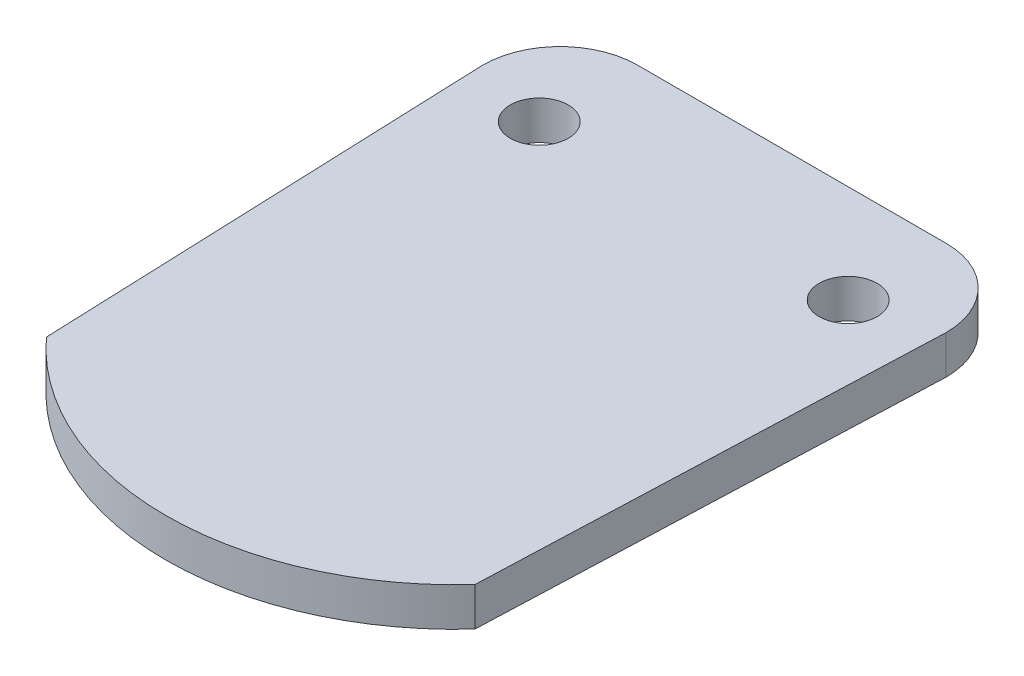
ISO-10303-21;
HEADER;
FILE_DESCRIPTION(('STEP AP214'),'2;1');
FILE_NAME('part.step','',(''),(''),'','','');
FILE_SCHEMA(('AUTOMOTIVE_DESIGN { 1 0 10303 214 1 1 1 1 }'));
ENDSEC;
DATA;
#1=APPLICATION_CONTEXT('core data for automotive mechanical design processes');
#2=APPLICATION_PROTOCOL_DEFINITION('international standard','automotive_design',2000,#1);
#3=PRODUCT_CONTEXT('',#1,'mechanical');
#4=PRODUCT('Part','Part','',(#3));
#5=PRODUCT_RELATED_PRODUCT_CATEGORY('part','',(#4));
#6=PRODUCT_DEFINITION_FORMATION('','',#4);
#7=PRODUCT_DEFINITION_CONTEXT('part definition',#1,'design');
#8=PRODUCT_DEFINITION('design','',#6,#7);
#9=PRODUCT_DEFINITION_SHAPE('','',#8);
#10=(LENGTH_UNIT() NAMED_UNIT(*) SI_UNIT(.MILLI.,.METRE.));
#11=(NAMED_UNIT(*) PLANE_ANGLE_UNIT() SI_UNIT($,.RADIAN.));
#12=(NAMED_UNIT(*) SI_UNIT($,.STERADIAN.) SOLID_ANGLE_UNIT());
#13=UNCERTAINTY_MEASURE_WITH_UNIT(LENGTH_MEASURE(1.E-05),#10,'distance_accuracy_value','');
#14=(GEOMETRIC_REPRESENTATION_CONTEXT(3) GLOBAL_UNCERTAINTY_ASSIGNED_CONTEXT((#13)) GLOBAL_UNIT_ASSIGNED_CONTEXT((#10,
#11,#12)) REPRESENTATION_CONTEXT('',''));
#15=CARTESIAN_POINT('',(0.,0.,0.));
#16=DIRECTION('',(0.,0.,1.));
#17=DIRECTION('',(1.,0.,0.));
#18=AXIS2_PLACEMENT_3D('',#15,#16,#17);
#19=CARTESIAN_POINT('',(-8.,2.,0.));
#20=DIRECTION('',(0.,-1.,0.));
#21=DIRECTION('',(0.,0.,-1.));
#22=AXIS2_PLACEMENT_3D('',#19,#20,#21);
#23=PLANE('',#22);
#24=CARTESIAN_POINT('',(-8.,2.,0.));
#25=DIRECTION('',(0.,1.,0.));
#26=DIRECTION('',(0.,0.,-1.));
#27=AXIS2_PLACEMENT_3D('',#24,#25,#26);
#28=CIRCLE('',#27,4.);
#29=CARTESIAN_POINT('',(-8.,2.,-4.));
#30=VERTEX_POINT('',#29);
#31=CARTESIAN_POINT('',(-12.,2.,0.));
#32=VERTEX_POINT('',#31);
#33=EDGE_CURVE('E133',#30,#32,#28,.T.);
#34=ORIENTED_EDGE('',*,*,#33,.T.);
#35=DIRECTION('',(0.0382960043178499,0.,0.999266438970752));
#36=VECTOR('',#35,1.);
#37=CARTESIAN_POINT('',(-12.,2.,0.));
#38=LINE('',#37,#36);
#39=CARTESIAN_POINT('',(-11.099,2.,23.51));
#40=VERTEX_POINT('',#39);
#41=EDGE_CURVE('E91',#32,#40,#38,.T.);
#42=ORIENTED_EDGE('',*,*,#41,.T.);
#43=CARTESIAN_POINT('',(0.,2.,13.4197968801416));
#44=DIRECTION('',(0.,1.,0.));
#45=DIRECTION('',(0.,0.,1.));
#46=AXIS2_PLACEMENT_3D('',#43,#44,#45);
#47=CIRCLE('',#46,15.);
#48=CARTESIAN_POINT('',(11.099,2.,23.51));
#49=VERTEX_POINT('',#48);
#50=EDGE_CURVE('E104',#40,#49,#47,.T.);
#51=ORIENTED_EDGE('',*,*,#50,.T.);
#52=DIRECTION('',(0.0382960043178496,0.,-0.999266438970752));
#53=VECTOR('',#52,1.);
#54=CARTESIAN_POINT('',(12.,2.,0.));
#55=LINE('',#54,#53);
#56=CARTESIAN_POINT('',(12.,2.,0.));
#57=VERTEX_POINT('',#56);
#58=EDGE_CURVE('E98',#49,#57,#55,.T.);
#59=ORIENTED_EDGE('',*,*,#58,.T.);
#60=CARTESIAN_POINT('',(8.,2.,0.));
#61=DIRECTION('',(0.,1.,0.));
#62=DIRECTION('',(0.,0.,1.));
#63=AXIS2_PLACEMENT_3D('',#60,#61,#62);
#64=CIRCLE('',#63,4.);
#65=CARTESIAN_POINT('',(8.,2.,-4.));
#66=VERTEX_POINT('',#65);
#67=EDGE_CURVE('E102',#57,#66,#64,.T.);
#68=ORIENTED_EDGE('',*,*,#67,.T.);
#69=DIRECTION('',(-1.,0.,0.));
#70=VECTOR('',#69,1.);
#71=CARTESIAN_POINT('',(-8.,2.,-4.));
#72=LINE('',#71,#70);
#73=EDGE_CURVE('E54',#66,#30,#72,.T.);
#74=ORIENTED_EDGE('',*,*,#73,.T.);
#75=EDGE_LOOP('',(#34,#42,#51,#59,#68,#74));
#76=FACE_BOUND('',#75,.T.);
#77=CARTESIAN_POINT('',(-8.,2.,1.08));
#78=DIRECTION('',(0.,1.,0.));
#79=DIRECTION('',(0.,0.,1.));
#80=AXIS2_PLACEMENT_3D('',#77,#78,#79);
#81=CIRCLE('',#80,1.5);
#82=CARTESIAN_POINT('',(-8.,2.,2.58));
#83=VERTEX_POINT('',#82);
#84=EDGE_CURVE('E126',#83,#83,#81,.T.);
#85=ORIENTED_EDGE('',*,*,#84,.F.);
#86=EDGE_LOOP('',(#85));
#87=FACE_BOUND('',#86,.T.);
#88=CARTESIAN_POINT('',(8.,2.,1.08));
#89=DIRECTION('',(0.,1.,0.));
#90=DIRECTION('',(0.,0.,1.));
#91=AXIS2_PLACEMENT_3D('',#88,#89,#90);
#92=CIRCLE('',#91,1.5);
#93=CARTESIAN_POINT('',(8.,2.,2.58));
#94=VERTEX_POINT('',#93);
#95=EDGE_CURVE('E174',#94,#94,#92,.T.);
#96=ORIENTED_EDGE('',*,*,#95,.F.);
#97=EDGE_LOOP('',(#96));
#98=FACE_BOUND('',#97,.T.);
#99=ADVANCED_FACE('F37',(#76,#87,#98),#23,.F.);
#100=CARTESIAN_POINT('',(-8.,0.,0.));
#101=DIRECTION('',(0.,-1.,0.));
#102=DIRECTION('',(0.,0.,-1.));
#103=AXIS2_PLACEMENT_3D('',#100,#101,#102);
#104=PLANE('',#103);
#105=CARTESIAN_POINT('',(-8.,0.,1.08));
#106=DIRECTION('',(0.,1.,0.));
#107=DIRECTION('',(0.,0.,1.));
#108=AXIS2_PLACEMENT_3D('',#105,#106,#107);
#109=CIRCLE('',#108,1.5);
#110=CARTESIAN_POINT('',(-8.,0.,2.58));
#111=VERTEX_POINT('',#110);
#112=EDGE_CURVE('E179',#111,#111,#109,.T.);
#113=ORIENTED_EDGE('',*,*,#112,.T.);
#114=EDGE_LOOP('',(#113));
#115=FACE_BOUND('',#114,.T.);
#116=CARTESIAN_POINT('',(-8.,0.,0.));
#117=DIRECTION('',(0.,1.,0.));
#118=DIRECTION('',(0.,0.,-1.));
#119=AXIS2_PLACEMENT_3D('',#116,#117,#118);
#120=CIRCLE('',#119,4.);
#121=CARTESIAN_POINT('',(-8.,0.,-4.));
#122=VERTEX_POINT('',#121);
#123=CARTESIAN_POINT('',(-12.,0.,0.));
#124=VERTEX_POINT('',#123);
#125=EDGE_CURVE('E122',#122,#124,#120,.T.);
#126=ORIENTED_EDGE('',*,*,#125,.F.);
#127=DIRECTION('',(-1.,0.,0.));
#128=VECTOR('',#127,1.);
#129=CARTESIAN_POINT('',(-8.,0.,-4.));
#130=LINE('',#129,#128);
#131=CARTESIAN_POINT('',(8.,0.,-4.));
#132=VERTEX_POINT('',#131);
#133=EDGE_CURVE('E83',#132,#122,#130,.T.);
#134=ORIENTED_EDGE('',*,*,#133,.F.);
#135=CARTESIAN_POINT('',(8.,0.,0.));
#136=DIRECTION('',(0.,1.,0.));
#137=DIRECTION('',(0.,0.,1.));
#138=AXIS2_PLACEMENT_3D('',#135,#136,#137);
#139=CIRCLE('',#138,4.);
#140=CARTESIAN_POINT('',(12.,0.,0.));
#141=VERTEX_POINT('',#140);
#142=EDGE_CURVE('E77',#141,#132,#139,.T.);
#143=ORIENTED_EDGE('',*,*,#142,.F.);
#144=DIRECTION('',(0.0382960043178496,0.,-0.999266438970752));
#145=VECTOR('',#144,1.);
#146=CARTESIAN_POINT('',(12.,0.,0.));
#147=LINE('',#146,#145);
#148=CARTESIAN_POINT('',(11.099,0.,23.51));
#149=VERTEX_POINT('',#148);
#150=EDGE_CURVE('E112',#149,#141,#147,.T.);
#151=ORIENTED_EDGE('',*,*,#150,.F.);
#152=CARTESIAN_POINT('',(0.,0.,13.4197968801416));
#153=DIRECTION('',(0.,1.,0.));
#154=DIRECTION('',(0.,0.,1.));
#155=AXIS2_PLACEMENT_3D('',#152,#153,#154);
#156=CIRCLE('',#155,15.);
#157=CARTESIAN_POINT('',(-11.099,0.,23.51));
#158=VERTEX_POINT('',#157);
#159=EDGE_CURVE('E128',#158,#149,#156,.T.);
#160=ORIENTED_EDGE('',*,*,#159,.F.);
#161=DIRECTION('',(0.0382960043178499,0.,0.999266438970752));
#162=VECTOR('',#161,1.);
#163=CARTESIAN_POINT('',(-12.,0.,0.));
#164=LINE('',#163,#162);
#165=EDGE_CURVE('E125',#124,#158,#164,.T.);
#166=ORIENTED_EDGE('',*,*,#165,.F.);
#167=EDGE_LOOP('',(#126,#134,#143,#151,#160,#166));
#168=FACE_BOUND('',#167,.T.);
#169=CARTESIAN_POINT('',(8.,0.,1.08));
#170=DIRECTION('',(0.,1.,0.));
#171=DIRECTION('',(0.,0.,1.));
#172=AXIS2_PLACEMENT_3D('',#169,#170,#171);
#173=CIRCLE('',#172,1.5);
#174=CARTESIAN_POINT('',(8.,0.,2.58));
#175=VERTEX_POINT('',#174);
#176=EDGE_CURVE('E177',#175,#175,#173,.T.);
#177=ORIENTED_EDGE('',*,*,#176,.T.);
#178=EDGE_LOOP('',(#177));
#179=FACE_BOUND('',#178,.T.);
#180=ADVANCED_FACE('F142',(#115,#168,#179),#104,.T.);
#181=CARTESIAN_POINT('',(-8.,2.,0.));
#182=DIRECTION('',(0.,-1.,0.));
#183=DIRECTION('',(0.,0.,-1.));
#184=AXIS2_PLACEMENT_3D('',#181,#182,#183);
#185=CYLINDRICAL_SURFACE('',#184,4.);
#186=ORIENTED_EDGE('',*,*,#125,.T.);
#187=DIRECTION('',(0.,-1.,0.));
#188=VECTOR('',#187,1.);
#189=CARTESIAN_POINT('',(-12.,2.,0.));
#190=LINE('',#189,#188);
#191=EDGE_CURVE('E11',#32,#124,#190,.T.);
#192=ORIENTED_EDGE('',*,*,#191,.F.);
#193=ORIENTED_EDGE('',*,*,#33,.F.);
#194=DIRECTION('',(0.,-1.,0.));
#195=VECTOR('',#194,1.);
#196=CARTESIAN_POINT('',(-8.,2.,-4.));
#197=LINE('',#196,#195);
#198=EDGE_CURVE('E118',#30,#122,#197,.T.);
#199=ORIENTED_EDGE('',*,*,#198,.T.);
#200=EDGE_LOOP('',(#186,#192,#193,#199));
#201=FACE_BOUND('',#200,.T.);
#202=ADVANCED_FACE('F39',(#201),#185,.T.);
#203=CARTESIAN_POINT('',(-12.,2.,0.));
#204=DIRECTION('',(0.999266438970752,0.,-0.0382960043178499));
#205=DIRECTION('',(-0.0382960043178499,0.,-0.999266438970752));
#206=AXIS2_PLACEMENT_3D('',#203,#204,#205);
#207=PLANE('',#206);
#208=ORIENTED_EDGE('',*,*,#165,.T.);
#209=DIRECTION('',(0.,-1.,0.));
#210=VECTOR('',#209,1.);
#211=CARTESIAN_POINT('',(-11.099,2.,23.51));
#212=LINE('',#211,#210);
#213=EDGE_CURVE('E46',#40,#158,#212,.T.);
#214=ORIENTED_EDGE('',*,*,#213,.F.);
#215=ORIENTED_EDGE('',*,*,#41,.F.);
#216=ORIENTED_EDGE('',*,*,#191,.T.);
#217=EDGE_LOOP('',(#208,#214,#215,#216));
#218=FACE_BOUND('',#217,.T.);
#219=ADVANCED_FACE('F222',(#218),#207,.F.);
#220=CARTESIAN_POINT('',(0.,2.,13.4197968801416));
#221=DIRECTION('',(0.,-1.,0.));
#222=DIRECTION('',(0.,0.,-1.));
#223=AXIS2_PLACEMENT_3D('',#220,#221,#222);
#224=CYLINDRICAL_SURFACE('',#223,15.);
#225=ORIENTED_EDGE('',*,*,#159,.T.);
#226=DIRECTION('',(0.,-1.,0.));
#227=VECTOR('',#226,1.);
#228=CARTESIAN_POINT('',(11.099,2.,23.51));
#229=LINE('',#228,#227);
#230=EDGE_CURVE('E113',#49,#149,#229,.T.);
#231=ORIENTED_EDGE('',*,*,#230,.F.);
#232=ORIENTED_EDGE('',*,*,#50,.F.);
#233=ORIENTED_EDGE('',*,*,#213,.T.);
#234=EDGE_LOOP('',(#225,#231,#232,#233));
#235=FACE_BOUND('',#234,.T.);
#236=ADVANCED_FACE('F139',(#235),#224,.T.);
#237=CARTESIAN_POINT('',(12.,2.,0.));
#238=DIRECTION('',(-0.999266438970752,0.,-0.0382960043178496));
#239=DIRECTION('',(-0.0382960043178496,0.,0.999266438970752));
#240=AXIS2_PLACEMENT_3D('',#237,#238,#239);
#241=PLANE('',#240);
#242=ORIENTED_EDGE('',*,*,#150,.T.);
#243=DIRECTION('',(0.,-1.,0.));
#244=VECTOR('',#243,1.);
#245=CARTESIAN_POINT('',(12.,2.,0.));
#246=LINE('',#245,#244);
#247=EDGE_CURVE('E109',#57,#141,#246,.T.);
#248=ORIENTED_EDGE('',*,*,#247,.F.);
#249=ORIENTED_EDGE('',*,*,#58,.F.);
#250=ORIENTED_EDGE('',*,*,#230,.T.);
#251=EDGE_LOOP('',(#242,#248,#249,#250));
#252=FACE_BOUND('',#251,.T.);
#253=ADVANCED_FACE('F110',(#252),#241,.F.);
#254=CARTESIAN_POINT('',(8.,2.,0.));
#255=DIRECTION('',(0.,-1.,0.));
#256=DIRECTION('',(0.,0.,-1.));
#257=AXIS2_PLACEMENT_3D('',#254,#255,#256);
#258=CYLINDRICAL_SURFACE('',#257,4.);
#259=ORIENTED_EDGE('',*,*,#142,.T.);
#260=DIRECTION('',(0.,-1.,0.));
#261=VECTOR('',#260,1.);
#262=CARTESIAN_POINT('',(8.,2.,-4.));
#263=LINE('',#262,#261);
#264=EDGE_CURVE('E114',#66,#132,#263,.T.);
#265=ORIENTED_EDGE('',*,*,#264,.F.);
#266=ORIENTED_EDGE('',*,*,#67,.F.);
#267=ORIENTED_EDGE('',*,*,#247,.T.);
#268=EDGE_LOOP('',(#259,#265,#266,#267));
#269=FACE_BOUND('',#268,.T.);
#270=ADVANCED_FACE('F116',(#269),#258,.T.);
#271=CARTESIAN_POINT('',(-8.,2.,-4.));
#272=DIRECTION('',(0.,0.,1.));
#273=DIRECTION('',(1.,0.,0.));
#274=AXIS2_PLACEMENT_3D('',#271,#272,#273);
#275=PLANE('',#274);
#276=ORIENTED_EDGE('',*,*,#133,.T.);
#277=ORIENTED_EDGE('',*,*,#198,.F.);
#278=ORIENTED_EDGE('',*,*,#73,.F.);
#279=ORIENTED_EDGE('',*,*,#264,.T.);
#280=EDGE_LOOP('',(#276,#277,#278,#279));
#281=FACE_BOUND('',#280,.T.);
#282=ADVANCED_FACE('F147',(#281),#275,.F.);
#283=CARTESIAN_POINT('',(-8.,2.,1.08));
#284=DIRECTION('',(0.,-1.,0.));
#285=DIRECTION('',(0.,0.,-1.));
#286=AXIS2_PLACEMENT_3D('',#283,#284,#285);
#287=CYLINDRICAL_SURFACE('',#286,1.5);
#288=ORIENTED_EDGE('',*,*,#84,.T.);
#289=EDGE_LOOP('',(#288));
#290=FACE_BOUND('',#289,.T.);
#291=ORIENTED_EDGE('',*,*,#112,.F.);
#292=EDGE_LOOP('',(#291));
#293=FACE_BOUND('',#292,.T.);
#294=ADVANCED_FACE('F149',(#290,#293),#287,.F.);
#295=CARTESIAN_POINT('',(8.,2.,1.08));
#296=DIRECTION('',(0.,-1.,0.));
#297=DIRECTION('',(0.,0.,-1.));
#298=AXIS2_PLACEMENT_3D('',#295,#296,#297);
#299=CYLINDRICAL_SURFACE('',#298,1.5);
#300=ORIENTED_EDGE('',*,*,#95,.T.);
#301=EDGE_LOOP('',(#300));
#302=FACE_BOUND('',#301,.T.);
#303=ORIENTED_EDGE('',*,*,#176,.F.);
#304=EDGE_LOOP('',(#303));
#305=FACE_BOUND('',#304,.T.);
#306=ADVANCED_FACE('F155',(#302,#305),#299,.F.);
#307=CLOSED_SHELL('',(#99,#180,#202,#219,#236,#253,#270,#282,#294,#306));
#308=MANIFOLD_SOLID_BREP('B2',#307);
#309=ADVANCED_BREP_SHAPE_REPRESENTATION('',(#18,#308),#14);
#310=SHAPE_DEFINITION_REPRESENTATION(#9,#309);
ENDSEC;
END-ISO-10303-21;
